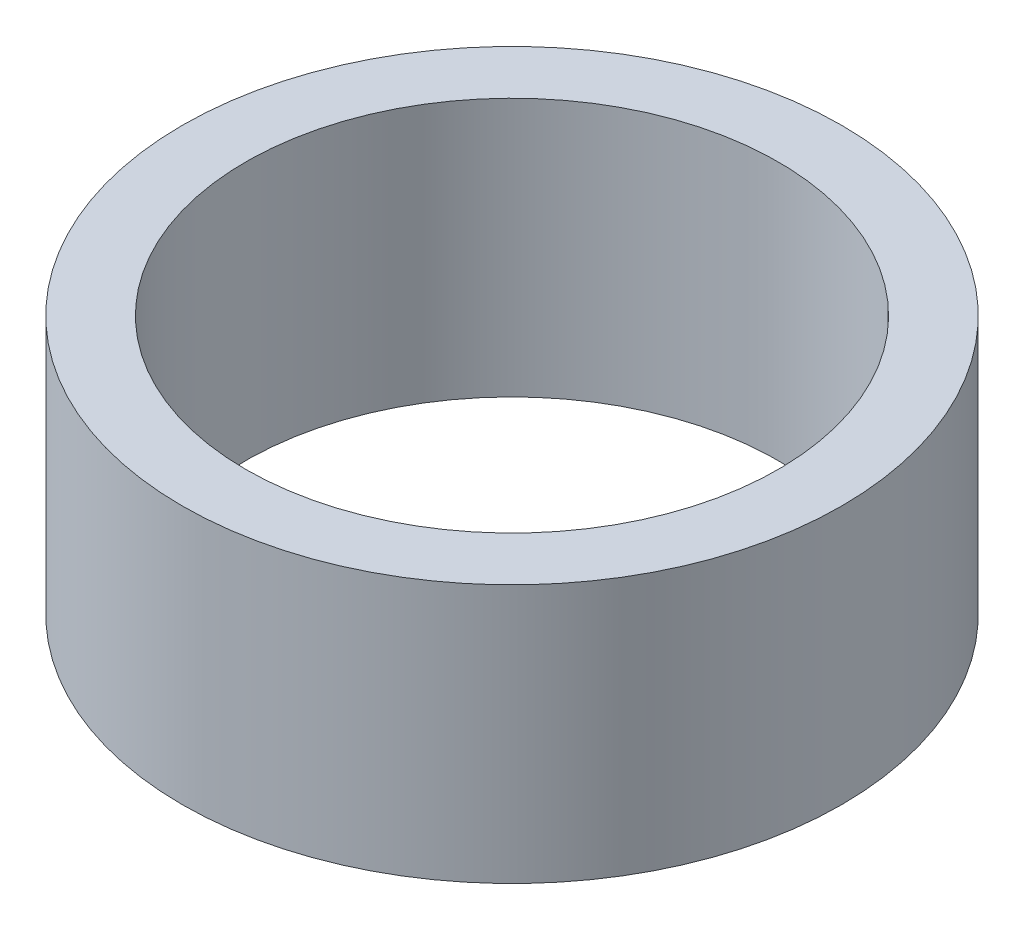
ISO-10303-21;
HEADER;
FILE_DESCRIPTION(('STEP AP214'),'2;1');
FILE_NAME('part.step','',(''),(''),'','','');
FILE_SCHEMA(('AUTOMOTIVE_DESIGN { 1 0 10303 214 1 1 1 1 }'));
ENDSEC;
DATA;
#1=APPLICATION_CONTEXT('core data for automotive mechanical design processes');
#2=APPLICATION_PROTOCOL_DEFINITION('international standard','automotive_design',2000,#1);
#3=PRODUCT_CONTEXT('',#1,'mechanical');
#4=PRODUCT('Part','Part','',(#3));
#5=PRODUCT_RELATED_PRODUCT_CATEGORY('part','',(#4));
#6=PRODUCT_DEFINITION_FORMATION('','',#4);
#7=PRODUCT_DEFINITION_CONTEXT('part definition',#1,'design');
#8=PRODUCT_DEFINITION('design','',#6,#7);
#9=PRODUCT_DEFINITION_SHAPE('','',#8);
#10=(LENGTH_UNIT() NAMED_UNIT(*) SI_UNIT(.MILLI.,.METRE.));
#11=(NAMED_UNIT(*) PLANE_ANGLE_UNIT() SI_UNIT($,.RADIAN.));
#12=(NAMED_UNIT(*) SI_UNIT($,.STERADIAN.) SOLID_ANGLE_UNIT());
#13=UNCERTAINTY_MEASURE_WITH_UNIT(LENGTH_MEASURE(1.E-05),#10,'distance_accuracy_value','');
#14=(GEOMETRIC_REPRESENTATION_CONTEXT(3) GLOBAL_UNCERTAINTY_ASSIGNED_CONTEXT((#13)) GLOBAL_UNIT_ASSIGNED_CONTEXT((#10,
#11,#12)) REPRESENTATION_CONTEXT('',''));
#15=CARTESIAN_POINT('',(0.,0.,0.));
#16=DIRECTION('',(0.,0.,1.));
#17=DIRECTION('',(1.,0.,0.));
#18=AXIS2_PLACEMENT_3D('',#15,#16,#17);
#19=CARTESIAN_POINT('',(0.,51.,0.));
#20=DIRECTION('',(0.,1.,0.));
#21=DIRECTION('',(0.,0.,1.));
#22=AXIS2_PLACEMENT_3D('',#19,#20,#21);
#23=PLANE('',#22);
#24=CARTESIAN_POINT('',(0.,51.,0.));
#25=DIRECTION('',(0.,1.,0.));
#26=DIRECTION('',(0.,0.,1.));
#27=AXIS2_PLACEMENT_3D('',#24,#25,#26);
#28=CIRCLE('',#27,65.);
#29=CARTESIAN_POINT('',(0.,51.,65.));
#30=VERTEX_POINT('',#29);
#31=EDGE_CURVE('E10',#30,#30,#28,.T.);
#32=ORIENTED_EDGE('',*,*,#31,.T.);
#33=EDGE_LOOP('',(#32));
#34=FACE_BOUND('',#33,.T.);
#35=CARTESIAN_POINT('',(0.,51.,0.));
#36=DIRECTION('',(0.,1.,0.));
#37=DIRECTION('',(0.,0.,1.));
#38=AXIS2_PLACEMENT_3D('',#35,#36,#37);
#39=CIRCLE('',#38,52.5);
#40=CARTESIAN_POINT('',(0.,51.,52.5));
#41=VERTEX_POINT('',#40);
#42=EDGE_CURVE('E50',#41,#41,#39,.T.);
#43=ORIENTED_EDGE('',*,*,#42,.F.);
#44=EDGE_LOOP('',(#43));
#45=FACE_BOUND('',#44,.T.);
#46=ADVANCED_FACE('F37',(#34,#45),#23,.T.);
#47=CARTESIAN_POINT('',(0.,0.,0.));
#48=DIRECTION('',(0.,1.,0.));
#49=DIRECTION('',(0.,0.,1.));
#50=AXIS2_PLACEMENT_3D('',#47,#48,#49);
#51=PLANE('',#50);
#52=CARTESIAN_POINT('',(0.,0.,0.));
#53=DIRECTION('',(0.,1.,0.));
#54=DIRECTION('',(0.,0.,1.));
#55=AXIS2_PLACEMENT_3D('',#52,#53,#54);
#56=CIRCLE('',#55,65.);
#57=CARTESIAN_POINT('',(0.,0.,65.));
#58=VERTEX_POINT('',#57);
#59=EDGE_CURVE('E41',#58,#58,#56,.T.);
#60=ORIENTED_EDGE('',*,*,#59,.F.);
#61=EDGE_LOOP('',(#60));
#62=FACE_BOUND('',#61,.T.);
#63=CARTESIAN_POINT('',(0.,0.,0.));
#64=DIRECTION('',(0.,1.,0.));
#65=DIRECTION('',(0.,0.,1.));
#66=AXIS2_PLACEMENT_3D('',#63,#64,#65);
#67=CIRCLE('',#66,52.5);
#68=CARTESIAN_POINT('',(0.,0.,52.5));
#69=VERTEX_POINT('',#68);
#70=EDGE_CURVE('E52',#69,#69,#67,.T.);
#71=ORIENTED_EDGE('',*,*,#70,.T.);
#72=EDGE_LOOP('',(#71));
#73=FACE_BOUND('',#72,.T.);
#74=ADVANCED_FACE('F64',(#62,#73),#51,.F.);
#75=CARTESIAN_POINT('',(0.,51.,0.));
#76=DIRECTION('',(0.,-1.,0.));
#77=DIRECTION('',(0.,0.,-1.));
#78=AXIS2_PLACEMENT_3D('',#75,#76,#77);
#79=CYLINDRICAL_SURFACE('',#78,65.);
#80=ORIENTED_EDGE('',*,*,#31,.F.);
#81=EDGE_LOOP('',(#80));
#82=FACE_BOUND('',#81,.T.);
#83=ORIENTED_EDGE('',*,*,#59,.T.);
#84=EDGE_LOOP('',(#83));
#85=FACE_BOUND('',#84,.T.);
#86=ADVANCED_FACE('F39',(#82,#85),#79,.T.);
#87=CARTESIAN_POINT('',(0.,51.,0.));
#88=DIRECTION('',(0.,-1.,0.));
#89=DIRECTION('',(0.,0.,-1.));
#90=AXIS2_PLACEMENT_3D('',#87,#88,#89);
#91=CYLINDRICAL_SURFACE('',#90,52.5);
#92=ORIENTED_EDGE('',*,*,#42,.T.);
#93=EDGE_LOOP('',(#92));
#94=FACE_BOUND('',#93,.T.);
#95=ORIENTED_EDGE('',*,*,#70,.F.);
#96=EDGE_LOOP('',(#95));
#97=FACE_BOUND('',#96,.T.);
#98=ADVANCED_FACE('F60',(#94,#97),#91,.F.);
#99=CLOSED_SHELL('',(#46,#74,#86,#98));
#100=MANIFOLD_SOLID_BREP('B2',#99);
#101=ADVANCED_BREP_SHAPE_REPRESENTATION('',(#18,#100),#14);
#102=SHAPE_DEFINITION_REPRESENTATION(#9,#101);
ENDSEC;
END-ISO-10303-21;
